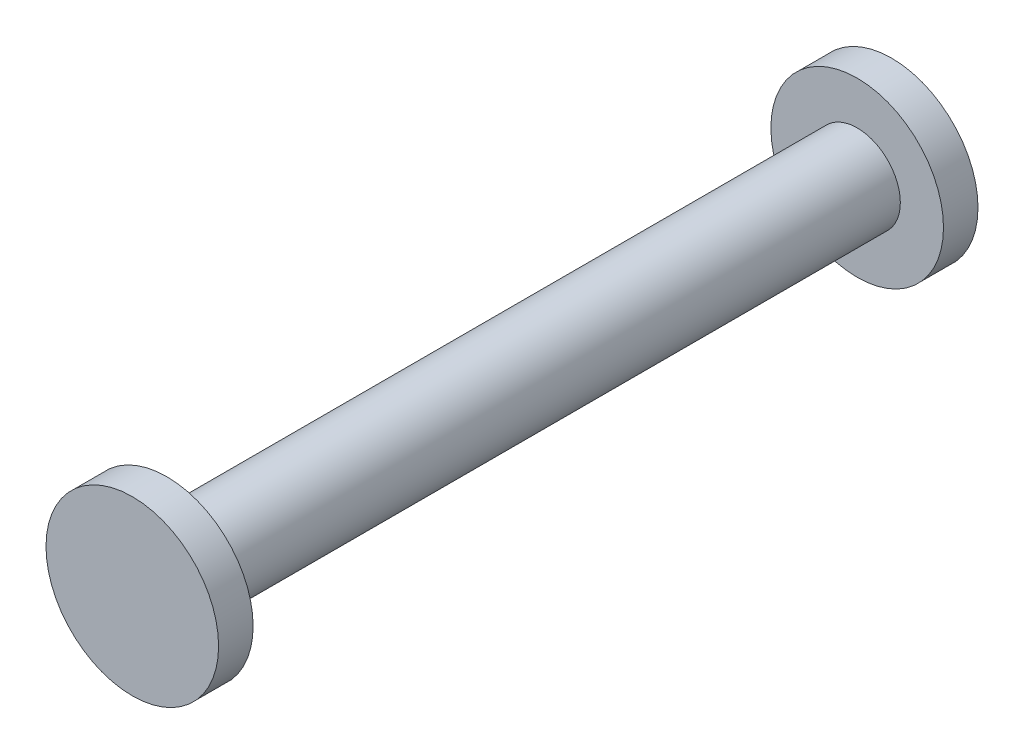
ISO-10303-21;
HEADER;
FILE_DESCRIPTION(('STEP AP214'),'2;1');
FILE_NAME('part.step','',(''),(''),'','','');
FILE_SCHEMA(('AUTOMOTIVE_DESIGN { 1 0 10303 214 1 1 1 1 }'));
ENDSEC;
DATA;
#1=APPLICATION_CONTEXT('core data for automotive mechanical design processes');
#2=APPLICATION_PROTOCOL_DEFINITION('international standard','automotive_design',2000,#1);
#3=PRODUCT_CONTEXT('',#1,'mechanical');
#4=PRODUCT('Part','Part','',(#3));
#5=PRODUCT_RELATED_PRODUCT_CATEGORY('part','',(#4));
#6=PRODUCT_DEFINITION_FORMATION('','',#4);
#7=PRODUCT_DEFINITION_CONTEXT('part definition',#1,'design');
#8=PRODUCT_DEFINITION('design','',#6,#7);
#9=PRODUCT_DEFINITION_SHAPE('','',#8);
#10=(LENGTH_UNIT() NAMED_UNIT(*) SI_UNIT(.MILLI.,.METRE.));
#11=(NAMED_UNIT(*) PLANE_ANGLE_UNIT() SI_UNIT($,.RADIAN.));
#12=(NAMED_UNIT(*) SI_UNIT($,.STERADIAN.) SOLID_ANGLE_UNIT());
#13=UNCERTAINTY_MEASURE_WITH_UNIT(LENGTH_MEASURE(1.E-05),#10,'distance_accuracy_value','');
#14=(GEOMETRIC_REPRESENTATION_CONTEXT(3) GLOBAL_UNCERTAINTY_ASSIGNED_CONTEXT((#13)) GLOBAL_UNIT_ASSIGNED_CONTEXT((#10,
#11,#12)) REPRESENTATION_CONTEXT('',''));
#15=CARTESIAN_POINT('',(0.,0.,0.));
#16=DIRECTION('',(0.,0.,1.));
#17=DIRECTION('',(1.,0.,0.));
#18=AXIS2_PLACEMENT_3D('',#15,#16,#17);
#19=CARTESIAN_POINT('',(0.,0.,50.8));
#20=DIRECTION('',(0.,0.,-1.));
#21=DIRECTION('',(-1.,0.,0.));
#22=AXIS2_PLACEMENT_3D('',#19,#20,#21);
#23=CYLINDRICAL_SURFACE('',#22,3.175);
#24=CARTESIAN_POINT('',(0.,0.,50.8));
#25=DIRECTION('',(0.,0.,1.));
#26=DIRECTION('',(1.,0.,0.));
#27=AXIS2_PLACEMENT_3D('',#24,#25,#26);
#28=CIRCLE('',#27,3.175);
#29=CARTESIAN_POINT('',(3.175,0.,50.8));
#30=VERTEX_POINT('',#29);
#31=EDGE_CURVE('E10',#30,#30,#28,.T.);
#32=ORIENTED_EDGE('',*,*,#31,.F.);
#33=EDGE_LOOP('',(#32));
#34=FACE_BOUND('',#33,.T.);
#35=CARTESIAN_POINT('',(0.,0.,0.));
#36=DIRECTION('',(0.,0.,1.));
#37=DIRECTION('',(1.,0.,0.));
#38=AXIS2_PLACEMENT_3D('',#35,#36,#37);
#39=CIRCLE('',#38,3.175);
#40=CARTESIAN_POINT('',(3.175,0.,0.));
#41=VERTEX_POINT('',#40);
#42=EDGE_CURVE('E40',#41,#41,#39,.T.);
#43=ORIENTED_EDGE('',*,*,#42,.T.);
#44=EDGE_LOOP('',(#43));
#45=FACE_BOUND('',#44,.T.);
#46=ADVANCED_FACE('F37',(#34,#45),#23,.T.);
#47=CARTESIAN_POINT('',(0.,0.,53.34));
#48=DIRECTION('',(0.,0.,-1.));
#49=DIRECTION('',(-1.,0.,0.));
#50=AXIS2_PLACEMENT_3D('',#47,#48,#49);
#51=CYLINDRICAL_SURFACE('',#50,6.35);
#52=CARTESIAN_POINT('',(0.,0.,53.34));
#53=DIRECTION('',(0.,0.,1.));
#54=DIRECTION('',(1.,0.,0.));
#55=AXIS2_PLACEMENT_3D('',#52,#53,#54);
#56=CIRCLE('',#55,6.35);
#57=CARTESIAN_POINT('',(6.35,0.,53.34));
#58=VERTEX_POINT('',#57);
#59=EDGE_CURVE('E45',#58,#58,#56,.T.);
#60=ORIENTED_EDGE('',*,*,#59,.F.);
#61=EDGE_LOOP('',(#60));
#62=FACE_BOUND('',#61,.T.);
#63=CARTESIAN_POINT('',(0.,0.,50.8));
#64=DIRECTION('',(0.,0.,1.));
#65=DIRECTION('',(1.,0.,0.));
#66=AXIS2_PLACEMENT_3D('',#63,#64,#65);
#67=CIRCLE('',#66,6.35);
#68=CARTESIAN_POINT('',(6.35,0.,50.8));
#69=VERTEX_POINT('',#68);
#70=EDGE_CURVE('E50',#69,#69,#67,.T.);
#71=ORIENTED_EDGE('',*,*,#70,.T.);
#72=EDGE_LOOP('',(#71));
#73=FACE_BOUND('',#72,.T.);
#74=ADVANCED_FACE('F91',(#62,#73),#51,.T.);
#75=CARTESIAN_POINT('',(0.,0.,53.34));
#76=DIRECTION('',(0.,0.,1.));
#77=DIRECTION('',(1.,0.,0.));
#78=AXIS2_PLACEMENT_3D('',#75,#76,#77);
#79=PLANE('',#78);
#80=ORIENTED_EDGE('',*,*,#59,.T.);
#81=EDGE_LOOP('',(#80));
#82=FACE_BOUND('',#81,.T.);
#83=ADVANCED_FACE('F87',(#82),#79,.T.);
#84=CARTESIAN_POINT('',(0.,0.,50.8));
#85=DIRECTION('',(0.,0.,1.));
#86=DIRECTION('',(1.,0.,0.));
#87=AXIS2_PLACEMENT_3D('',#84,#85,#86);
#88=PLANE('',#87);
#89=ORIENTED_EDGE('',*,*,#31,.T.);
#90=EDGE_LOOP('',(#89));
#91=FACE_BOUND('',#90,.T.);
#92=ORIENTED_EDGE('',*,*,#70,.F.);
#93=EDGE_LOOP('',(#92));
#94=FACE_BOUND('',#93,.T.);
#95=ADVANCED_FACE('F79',(#91,#94),#88,.F.);
#96=CARTESIAN_POINT('',(0.,0.,-2.54));
#97=DIRECTION('',(0.,0.,1.));
#98=DIRECTION('',(1.,0.,0.));
#99=AXIS2_PLACEMENT_3D('',#96,#97,#98);
#100=CYLINDRICAL_SURFACE('',#99,6.35);
#101=CARTESIAN_POINT('',(0.,0.,-2.54));
#102=DIRECTION('',(0.,0.,1.));
#103=DIRECTION('',(1.,0.,0.));
#104=AXIS2_PLACEMENT_3D('',#101,#102,#103);
#105=CIRCLE('',#104,6.35);
#106=CARTESIAN_POINT('',(6.35,0.,-2.54));
#107=VERTEX_POINT('',#106);
#108=EDGE_CURVE('E60',#107,#107,#105,.T.);
#109=ORIENTED_EDGE('',*,*,#108,.T.);
#110=EDGE_LOOP('',(#109));
#111=FACE_BOUND('',#110,.T.);
#112=CARTESIAN_POINT('',(0.,0.,0.));
#113=DIRECTION('',(0.,0.,1.));
#114=DIRECTION('',(1.,0.,0.));
#115=AXIS2_PLACEMENT_3D('',#112,#113,#114);
#116=CIRCLE('',#115,6.35);
#117=CARTESIAN_POINT('',(6.35,0.,0.));
#118=VERTEX_POINT('',#117);
#119=EDGE_CURVE('E56',#118,#118,#116,.T.);
#120=ORIENTED_EDGE('',*,*,#119,.F.);
#121=EDGE_LOOP('',(#120));
#122=FACE_BOUND('',#121,.T.);
#123=ADVANCED_FACE('F77',(#111,#122),#100,.T.);
#124=CARTESIAN_POINT('',(0.,0.,-2.54));
#125=DIRECTION('',(0.,0.,-1.));
#126=DIRECTION('',(1.,0.,0.));
#127=AXIS2_PLACEMENT_3D('',#124,#125,#126);
#128=PLANE('',#127);
#129=ORIENTED_EDGE('',*,*,#108,.F.);
#130=EDGE_LOOP('',(#129));
#131=FACE_BOUND('',#130,.T.);
#132=ADVANCED_FACE('F73',(#131),#128,.T.);
#133=CARTESIAN_POINT('',(0.,0.,0.));
#134=DIRECTION('',(0.,0.,-1.));
#135=DIRECTION('',(1.,0.,0.));
#136=AXIS2_PLACEMENT_3D('',#133,#134,#135);
#137=PLANE('',#136);
#138=ORIENTED_EDGE('',*,*,#42,.F.);
#139=EDGE_LOOP('',(#138));
#140=FACE_BOUND('',#139,.T.);
#141=ORIENTED_EDGE('',*,*,#119,.T.);
#142=EDGE_LOOP('',(#141));
#143=FACE_BOUND('',#142,.T.);
#144=ADVANCED_FACE('F70',(#140,#143),#137,.F.);
#145=CLOSED_SHELL('',(#46,#74,#83,#95,#123,#132,#144));
#146=MANIFOLD_SOLID_BREP('B2',#145);
#147=ADVANCED_BREP_SHAPE_REPRESENTATION('',(#18,#146),#14);
#148=SHAPE_DEFINITION_REPRESENTATION(#9,#147);
ENDSEC;
END-ISO-10303-21;
